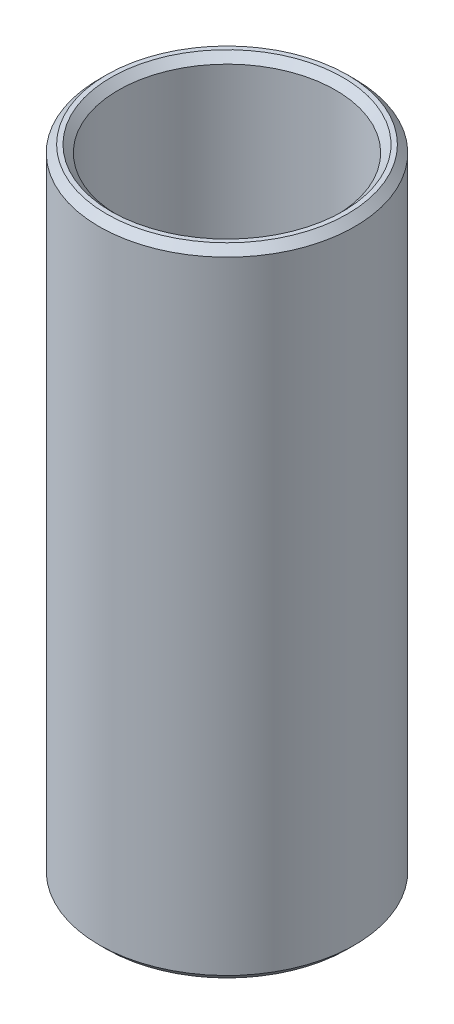
ISO-10303-21;
HEADER;
FILE_DESCRIPTION(('STEP AP214'),'2;1');
FILE_NAME('part.step','',(''),(''),'','','');
FILE_SCHEMA(('AUTOMOTIVE_DESIGN { 1 0 10303 214 1 1 1 1 }'));
ENDSEC;
DATA;
#1=APPLICATION_CONTEXT('core data for automotive mechanical design processes');
#2=APPLICATION_PROTOCOL_DEFINITION('international standard','automotive_design',2000,#1);
#3=PRODUCT_CONTEXT('',#1,'mechanical');
#4=PRODUCT('Part','Part','',(#3));
#5=PRODUCT_RELATED_PRODUCT_CATEGORY('part','',(#4));
#6=PRODUCT_DEFINITION_FORMATION('','',#4);
#7=PRODUCT_DEFINITION_CONTEXT('part definition',#1,'design');
#8=PRODUCT_DEFINITION('design','',#6,#7);
#9=PRODUCT_DEFINITION_SHAPE('','',#8);
#10=(LENGTH_UNIT() NAMED_UNIT(*) SI_UNIT(.MILLI.,.METRE.));
#11=(NAMED_UNIT(*) PLANE_ANGLE_UNIT() SI_UNIT($,.RADIAN.));
#12=(NAMED_UNIT(*) SI_UNIT($,.STERADIAN.) SOLID_ANGLE_UNIT());
#13=UNCERTAINTY_MEASURE_WITH_UNIT(LENGTH_MEASURE(1.E-05),#10,'distance_accuracy_value','');
#14=(GEOMETRIC_REPRESENTATION_CONTEXT(3) GLOBAL_UNCERTAINTY_ASSIGNED_CONTEXT((#13)) GLOBAL_UNIT_ASSIGNED_CONTEXT((#10,
#11,#12)) REPRESENTATION_CONTEXT('',''));
#15=CARTESIAN_POINT('',(0.,0.,0.));
#16=DIRECTION('',(0.,0.,1.));
#17=DIRECTION('',(1.,0.,0.));
#18=AXIS2_PLACEMENT_3D('',#15,#16,#17);
#19=CARTESIAN_POINT('',(0.,273.943988282495,0.));
#20=DIRECTION('',(0.,-1.,0.));
#21=DIRECTION('',(0.,0.,-1.));
#22=AXIS2_PLACEMENT_3D('',#19,#20,#21);
#23=CYLINDRICAL_SURFACE('',#22,55.);
#24=CARTESIAN_POINT('',(0.,3.15126527383752,0.));
#25=DIRECTION('',(0.,1.,0.));
#26=DIRECTION('',(0.,0.,1.));
#27=AXIS2_PLACEMENT_3D('',#24,#25,#26);
#28=CIRCLE('',#27,55.);
#29=CARTESIAN_POINT('',(0.,3.15126527383752,55.));
#30=VERTEX_POINT('',#29);
#31=EDGE_CURVE('E10',#30,#30,#28,.T.);
#32=ORIENTED_EDGE('',*,*,#31,.T.);
#33=EDGE_LOOP('',(#32));
#34=FACE_BOUND('',#33,.T.);
#35=CARTESIAN_POINT('',(0.,270.792723008658,0.));
#36=DIRECTION('',(0.,1.,0.));
#37=DIRECTION('',(0.,0.,1.));
#38=AXIS2_PLACEMENT_3D('',#35,#36,#37);
#39=CIRCLE('',#38,55.);
#40=CARTESIAN_POINT('',(0.,270.792723008658,55.));
#41=VERTEX_POINT('',#40);
#42=EDGE_CURVE('E50',#41,#41,#39,.F.);
#43=ORIENTED_EDGE('',*,*,#42,.T.);
#44=EDGE_LOOP('',(#43));
#45=FACE_BOUND('',#44,.T.);
#46=ADVANCED_FACE('F39',(#34,#45),#23,.T.);
#47=CARTESIAN_POINT('',(0.,273.943988282495,0.));
#48=DIRECTION('',(0.,1.,0.));
#49=DIRECTION('',(0.,0.,1.));
#50=AXIS2_PLACEMENT_3D('',#47,#48,#49);
#51=PLANE('',#50);
#52=CARTESIAN_POINT('',(0.,273.943988282495,0.));
#53=DIRECTION('',(0.,1.,0.));
#54=DIRECTION('',(0.,0.,1.));
#55=AXIS2_PLACEMENT_3D('',#52,#53,#54);
#56=CIRCLE('',#55,49.9120990765743);
#57=CARTESIAN_POINT('',(0.,273.943988282495,49.9120990765743));
#58=VERTEX_POINT('',#57);
#59=EDGE_CURVE('E58',#58,#58,#56,.F.);
#60=ORIENTED_EDGE('',*,*,#59,.T.);
#61=EDGE_LOOP('',(#60));
#62=FACE_BOUND('',#61,.T.);
#63=CARTESIAN_POINT('',(0.,273.943988282495,0.));
#64=DIRECTION('',(0.,1.,0.));
#65=DIRECTION('',(0.,0.,1.));
#66=AXIS2_PLACEMENT_3D('',#63,#64,#65);
#67=CIRCLE('',#66,51.8487347261625);
#68=CARTESIAN_POINT('',(0.,273.943988282495,51.8487347261625));
#69=VERTEX_POINT('',#68);
#70=EDGE_CURVE('E61',#69,#69,#67,.T.);
#71=ORIENTED_EDGE('',*,*,#70,.T.);
#72=EDGE_LOOP('',(#71));
#73=FACE_BOUND('',#72,.T.);
#74=ADVANCED_FACE('F88',(#62,#73),#51,.T.);
#75=CARTESIAN_POINT('',(0.,0.,0.));
#76=DIRECTION('',(0.,1.,0.));
#77=DIRECTION('',(0.,0.,1.));
#78=AXIS2_PLACEMENT_3D('',#75,#76,#77);
#79=PLANE('',#78);
#80=CARTESIAN_POINT('',(0.,0.,0.));
#81=DIRECTION('',(0.,1.,0.));
#82=DIRECTION('',(0.,0.,1.));
#83=AXIS2_PLACEMENT_3D('',#80,#81,#82);
#84=CIRCLE('',#83,49.9120990765744);
#85=CARTESIAN_POINT('',(0.,0.,49.9120990765744));
#86=VERTEX_POINT('',#85);
#87=EDGE_CURVE('E51',#86,#86,#84,.T.);
#88=ORIENTED_EDGE('',*,*,#87,.T.);
#89=EDGE_LOOP('',(#88));
#90=FACE_BOUND('',#89,.T.);
#91=CARTESIAN_POINT('',(0.,0.,0.));
#92=DIRECTION('',(0.,1.,0.));
#93=DIRECTION('',(0.,0.,1.));
#94=AXIS2_PLACEMENT_3D('',#91,#92,#93);
#95=CIRCLE('',#94,51.8487347261625);
#96=CARTESIAN_POINT('',(0.,0.,51.8487347261625));
#97=VERTEX_POINT('',#96);
#98=EDGE_CURVE('E54',#97,#97,#95,.F.);
#99=ORIENTED_EDGE('',*,*,#98,.T.);
#100=EDGE_LOOP('',(#99));
#101=FACE_BOUND('',#100,.T.);
#102=ADVANCED_FACE('F83',(#90,#101),#79,.F.);
#103=CARTESIAN_POINT('',(0.,273.943988282495,0.));
#104=DIRECTION('',(0.,-1.,0.));
#105=DIRECTION('',(0.,0.,-1.));
#106=AXIS2_PLACEMENT_3D('',#103,#104,#105);
#107=CYLINDRICAL_SURFACE('',#106,46.7608338027369);
#108=CARTESIAN_POINT('',(0.,270.792723008658,0.));
#109=DIRECTION('',(0.,1.,0.));
#110=DIRECTION('',(0.,0.,1.));
#111=AXIS2_PLACEMENT_3D('',#108,#109,#110);
#112=CIRCLE('',#111,46.7608338027369);
#113=CARTESIAN_POINT('',(0.,270.792723008658,46.7608338027369));
#114=VERTEX_POINT('',#113);
#115=EDGE_CURVE('E67',#114,#114,#112,.T.);
#116=ORIENTED_EDGE('',*,*,#115,.T.);
#117=EDGE_LOOP('',(#116));
#118=FACE_BOUND('',#117,.T.);
#119=CARTESIAN_POINT('',(0.,3.15126527383752,0.));
#120=DIRECTION('',(0.,1.,0.));
#121=DIRECTION('',(0.,0.,1.));
#122=AXIS2_PLACEMENT_3D('',#119,#120,#121);
#123=CIRCLE('',#122,46.7608338027369);
#124=CARTESIAN_POINT('',(0.,3.15126527383752,46.7608338027369));
#125=VERTEX_POINT('',#124);
#126=EDGE_CURVE('E69',#125,#125,#123,.F.);
#127=ORIENTED_EDGE('',*,*,#126,.T.);
#128=EDGE_LOOP('',(#127));
#129=FACE_BOUND('',#128,.T.);
#130=ADVANCED_FACE('F71',(#118,#129),#107,.F.);
#131=CARTESIAN_POINT('',(0.,270.792723008658,0.));
#132=DIRECTION('',(0.,1.,0.));
#133=DIRECTION('',(0.,0.,1.));
#134=AXIS2_PLACEMENT_3D('',#131,#132,#133);
#135=CONICAL_SURFACE('',#134,46.7608338027369,0.785398163397455);
#136=ORIENTED_EDGE('',*,*,#59,.F.);
#137=EDGE_LOOP('',(#136));
#138=FACE_BOUND('',#137,.T.);
#139=ORIENTED_EDGE('',*,*,#115,.F.);
#140=EDGE_LOOP('',(#139));
#141=FACE_BOUND('',#140,.T.);
#142=ADVANCED_FACE('F77',(#138,#141),#135,.F.);
#143=CARTESIAN_POINT('',(0.,0.,0.));
#144=DIRECTION('',(0.,-1.,0.));
#145=DIRECTION('',(0.,0.,-1.));
#146=AXIS2_PLACEMENT_3D('',#143,#144,#145);
#147=CONICAL_SURFACE('',#146,49.9120990765744,0.785398163397448);
#148=ORIENTED_EDGE('',*,*,#126,.F.);
#149=EDGE_LOOP('',(#148));
#150=FACE_BOUND('',#149,.T.);
#151=ORIENTED_EDGE('',*,*,#87,.F.);
#152=EDGE_LOOP('',(#151));
#153=FACE_BOUND('',#152,.T.);
#154=ADVANCED_FACE('F73',(#150,#153),#147,.F.);
#155=CARTESIAN_POINT('',(0.,3.15126527383752,0.));
#156=DIRECTION('',(0.,1.,0.));
#157=DIRECTION('',(0.,0.,1.));
#158=AXIS2_PLACEMENT_3D('',#155,#156,#157);
#159=CONICAL_SURFACE('',#158,55.,0.785398163397449);
#160=ORIENTED_EDGE('',*,*,#98,.F.);
#161=EDGE_LOOP('',(#160));
#162=FACE_BOUND('',#161,.T.);
#163=ORIENTED_EDGE('',*,*,#31,.F.);
#164=EDGE_LOOP('',(#163));
#165=FACE_BOUND('',#164,.T.);
#166=ADVANCED_FACE('F76',(#162,#165),#159,.T.);
#167=CARTESIAN_POINT('',(0.,273.943988282495,0.));
#168=DIRECTION('',(0.,-1.,0.));
#169=DIRECTION('',(0.,0.,-1.));
#170=AXIS2_PLACEMENT_3D('',#167,#168,#169);
#171=CONICAL_SURFACE('',#170,51.8487347261625,0.785398163397449);
#172=ORIENTED_EDGE('',*,*,#42,.F.);
#173=EDGE_LOOP('',(#172));
#174=FACE_BOUND('',#173,.T.);
#175=ORIENTED_EDGE('',*,*,#70,.F.);
#176=EDGE_LOOP('',(#175));
#177=FACE_BOUND('',#176,.T.);
#178=ADVANCED_FACE('F45',(#174,#177),#171,.T.);
#179=CLOSED_SHELL('',(#46,#74,#102,#130,#142,#154,#166,#178));
#180=MANIFOLD_SOLID_BREP('B2',#179);
#181=ADVANCED_BREP_SHAPE_REPRESENTATION('',(#18,#180),#14);
#182=SHAPE_DEFINITION_REPRESENTATION(#9,#181);
ENDSEC;
END-ISO-10303-21;
